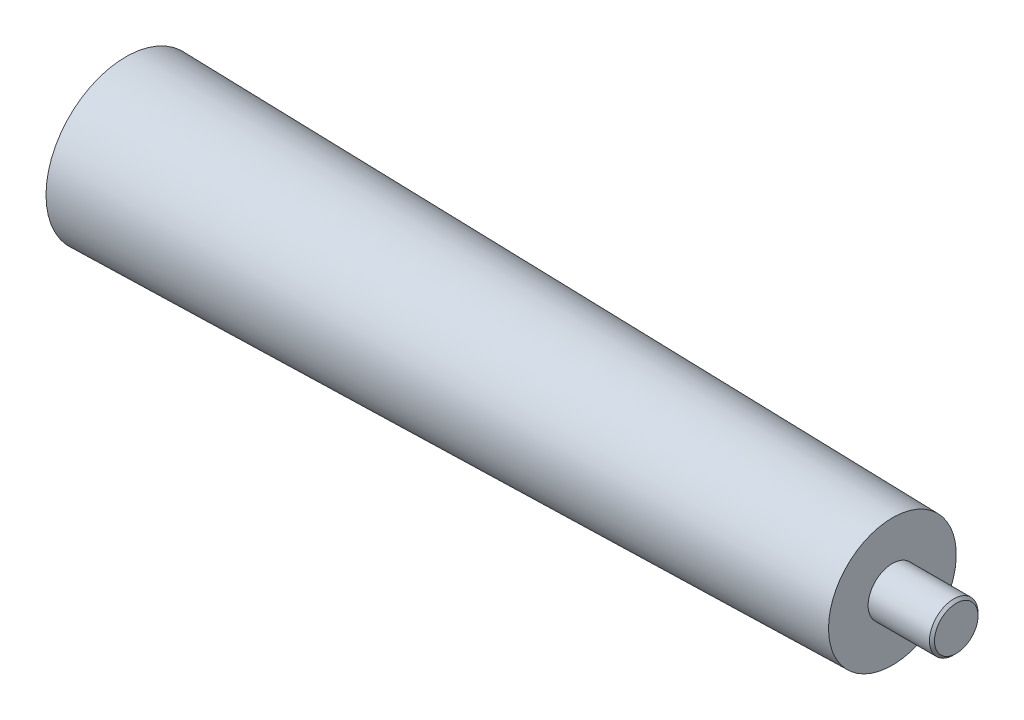
ISO-10303-21;
HEADER;
FILE_DESCRIPTION(('STEP AP214'),'2;1');
FILE_NAME('part.step','',(''),(''),'','','');
FILE_SCHEMA(('AUTOMOTIVE_DESIGN { 1 0 10303 214 1 1 1 1 }'));
ENDSEC;
DATA;
#1=APPLICATION_CONTEXT('core data for automotive mechanical design processes');
#2=APPLICATION_PROTOCOL_DEFINITION('international standard','automotive_design',2000,#1);
#3=PRODUCT_CONTEXT('',#1,'mechanical');
#4=PRODUCT('Part','Part','',(#3));
#5=PRODUCT_RELATED_PRODUCT_CATEGORY('part','',(#4));
#6=PRODUCT_DEFINITION_FORMATION('','',#4);
#7=PRODUCT_DEFINITION_CONTEXT('part definition',#1,'design');
#8=PRODUCT_DEFINITION('design','',#6,#7);
#9=PRODUCT_DEFINITION_SHAPE('','',#8);
#10=(LENGTH_UNIT() NAMED_UNIT(*) SI_UNIT(.MILLI.,.METRE.));
#11=(NAMED_UNIT(*) PLANE_ANGLE_UNIT() SI_UNIT($,.RADIAN.));
#12=(NAMED_UNIT(*) SI_UNIT($,.STERADIAN.) SOLID_ANGLE_UNIT());
#13=UNCERTAINTY_MEASURE_WITH_UNIT(LENGTH_MEASURE(1.E-05),#10,'distance_accuracy_value','');
#14=(GEOMETRIC_REPRESENTATION_CONTEXT(3) GLOBAL_UNCERTAINTY_ASSIGNED_CONTEXT((#13)) GLOBAL_UNIT_ASSIGNED_CONTEXT((#10,
#11,#12)) REPRESENTATION_CONTEXT('',''));
#15=CARTESIAN_POINT('',(0.,0.,0.));
#16=DIRECTION('',(0.,0.,1.));
#17=DIRECTION('',(1.,0.,0.));
#18=AXIS2_PLACEMENT_3D('',#15,#16,#17);
#19=CARTESIAN_POINT('',(0.,0.,-15.88));
#20=DIRECTION('',(1.,0.,0.));
#21=DIRECTION('',(0.,0.,-1.));
#22=AXIS2_PLACEMENT_3D('',#19,#20,#21);
#23=PLANE('',#22);
#24=CARTESIAN_POINT('',(0.,0.,0.));
#25=DIRECTION('',(-1.,0.,0.));
#26=DIRECTION('',(0.,0.,1.));
#27=AXIS2_PLACEMENT_3D('',#24,#25,#26);
#28=CIRCLE('',#27,15.88);
#29=CARTESIAN_POINT('',(0.,0.,15.8800000000001));
#30=VERTEX_POINT('',#29);
#31=EDGE_CURVE('E75',#30,#30,#28,.T.);
#32=ORIENTED_EDGE('',*,*,#31,.T.);
#33=EDGE_LOOP('',(#32));
#34=FACE_BOUND('',#33,.T.);
#35=ADVANCED_FACE('F48',(#34),#23,.F.);
#36=CARTESIAN_POINT('',(165.1,0.,0.));
#37=DIRECTION('',(-1.,0.,0.));
#38=DIRECTION('',(0.,0.,1.));
#39=AXIS2_PLACEMENT_3D('',#36,#37,#38);
#40=PLANE('',#39);
#41=CARTESIAN_POINT('',(165.1,0.,0.));
#42=DIRECTION('',(-1.,0.,0.));
#43=DIRECTION('',(0.,0.,1.));
#44=AXIS2_PLACEMENT_3D('',#41,#42,#43);
#45=CIRCLE('',#44,4.32999999999997);
#46=CARTESIAN_POINT('',(165.1,0.,4.32999999999999));
#47=VERTEX_POINT('',#46);
#48=EDGE_CURVE('E12',#47,#47,#45,.F.);
#49=ORIENTED_EDGE('',*,*,#48,.T.);
#50=EDGE_LOOP('',(#49));
#51=FACE_BOUND('',#50,.T.);
#52=ADVANCED_FACE('F96',(#51),#40,.F.);
#53=CARTESIAN_POINT('',(0.,0.,0.));
#54=DIRECTION('',(-1.,0.,0.));
#55=DIRECTION('',(0.,0.,1.));
#56=AXIS2_PLACEMENT_3D('',#53,#54,#55);
#57=CYLINDRICAL_SURFACE('',#56,4.82999999999999);
#58=CARTESIAN_POINT('',(164.6,0.,0.));
#59=DIRECTION('',(-1.,0.,0.));
#60=DIRECTION('',(0.,0.,1.));
#61=AXIS2_PLACEMENT_3D('',#58,#59,#60);
#62=CIRCLE('',#61,4.82999999999999);
#63=CARTESIAN_POINT('',(164.6,0.,4.83000000000001));
#64=VERTEX_POINT('',#63);
#65=EDGE_CURVE('E57',#64,#64,#62,.T.);
#66=ORIENTED_EDGE('',*,*,#65,.T.);
#67=EDGE_LOOP('',(#66));
#68=FACE_BOUND('',#67,.T.);
#69=CARTESIAN_POINT('',(152.4,0.,0.));
#70=DIRECTION('',(-1.,0.,0.));
#71=DIRECTION('',(0.,0.,1.));
#72=AXIS2_PLACEMENT_3D('',#69,#70,#71);
#73=CIRCLE('',#72,4.82999999999999);
#74=CARTESIAN_POINT('',(152.4,0.,4.83000000000001));
#75=VERTEX_POINT('',#74);
#76=EDGE_CURVE('E63',#75,#75,#73,.T.);
#77=ORIENTED_EDGE('',*,*,#76,.F.);
#78=EDGE_LOOP('',(#77));
#79=FACE_BOUND('',#78,.T.);
#80=ADVANCED_FACE('F91',(#68,#79),#57,.T.);
#81=CARTESIAN_POINT('',(152.4,0.,-4.83000000000001));
#82=DIRECTION('',(-1.,0.,0.));
#83=DIRECTION('',(0.,0.,1.));
#84=AXIS2_PLACEMENT_3D('',#81,#82,#83);
#85=PLANE('',#84);
#86=CARTESIAN_POINT('',(152.4,0.,0.));
#87=DIRECTION('',(-1.,0.,0.));
#88=DIRECTION('',(0.,0.,1.));
#89=AXIS2_PLACEMENT_3D('',#86,#87,#88);
#90=CIRCLE('',#89,12.7);
#91=CARTESIAN_POINT('',(152.4,0.,12.7));
#92=VERTEX_POINT('',#91);
#93=EDGE_CURVE('E69',#92,#92,#90,.T.);
#94=ORIENTED_EDGE('',*,*,#93,.F.);
#95=EDGE_LOOP('',(#94));
#96=FACE_BOUND('',#95,.T.);
#97=ORIENTED_EDGE('',*,*,#76,.T.);
#98=EDGE_LOOP('',(#97));
#99=FACE_BOUND('',#98,.T.);
#100=ADVANCED_FACE('F85',(#96,#99),#85,.F.);
#101=CARTESIAN_POINT('',(152.4,0.,0.));
#102=DIRECTION('',(-1.,0.,0.));
#103=DIRECTION('',(0.,0.,1.));
#104=AXIS2_PLACEMENT_3D('',#101,#102,#103);
#105=CONICAL_SURFACE('',#104,12.7,0.0208631141791714);
#106=ORIENTED_EDGE('',*,*,#31,.F.);
#107=EDGE_LOOP('',(#106));
#108=FACE_BOUND('',#107,.T.);
#109=ORIENTED_EDGE('',*,*,#93,.T.);
#110=EDGE_LOOP('',(#109));
#111=FACE_BOUND('',#110,.T.);
#112=ADVANCED_FACE('F82',(#108,#111),#105,.T.);
#113=CARTESIAN_POINT('',(164.6,0.,0.));
#114=DIRECTION('',(-1.,0.,0.));
#115=DIRECTION('',(0.,0.,1.));
#116=AXIS2_PLACEMENT_3D('',#113,#114,#115);
#117=CONICAL_SURFACE('',#116,4.82999999999999,0.785398163397467);
#118=ORIENTED_EDGE('',*,*,#48,.F.);
#119=EDGE_LOOP('',(#118));
#120=FACE_BOUND('',#119,.T.);
#121=ORIENTED_EDGE('',*,*,#65,.F.);
#122=EDGE_LOOP('',(#121));
#123=FACE_BOUND('',#122,.T.);
#124=ADVANCED_FACE('F51',(#120,#123),#117,.T.);
#125=CLOSED_SHELL('',(#35,#52,#80,#100,#112,#124));
#126=MANIFOLD_SOLID_BREP('B2',#125);
#127=ADVANCED_BREP_SHAPE_REPRESENTATION('',(#18,#126),#14);
#128=SHAPE_DEFINITION_REPRESENTATION(#9,#127);
ENDSEC;
END-ISO-10303-21;
